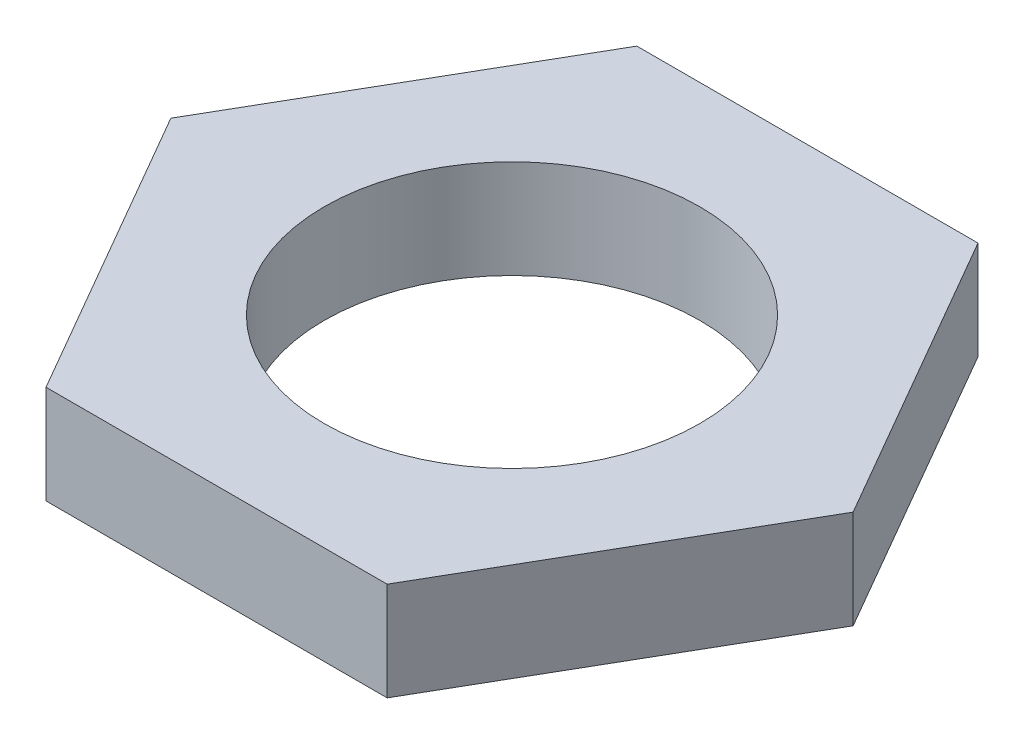
ISO-10303-21;
HEADER;
FILE_DESCRIPTION(('STEP AP214'),'2;1');
FILE_NAME('part.step','',(''),(''),'','','');
FILE_SCHEMA(('AUTOMOTIVE_DESIGN { 1 0 10303 214 1 1 1 1 }'));
ENDSEC;
DATA;
#1=APPLICATION_CONTEXT('core data for automotive mechanical design processes');
#2=APPLICATION_PROTOCOL_DEFINITION('international standard','automotive_design',2000,#1);
#3=PRODUCT_CONTEXT('',#1,'mechanical');
#4=PRODUCT('Part','Part','',(#3));
#5=PRODUCT_RELATED_PRODUCT_CATEGORY('part','',(#4));
#6=PRODUCT_DEFINITION_FORMATION('','',#4);
#7=PRODUCT_DEFINITION_CONTEXT('part definition',#1,'design');
#8=PRODUCT_DEFINITION('design','',#6,#7);
#9=PRODUCT_DEFINITION_SHAPE('','',#8);
#10=(LENGTH_UNIT() NAMED_UNIT(*) SI_UNIT(.MILLI.,.METRE.));
#11=(NAMED_UNIT(*) PLANE_ANGLE_UNIT() SI_UNIT($,.RADIAN.));
#12=(NAMED_UNIT(*) SI_UNIT($,.STERADIAN.) SOLID_ANGLE_UNIT());
#13=UNCERTAINTY_MEASURE_WITH_UNIT(LENGTH_MEASURE(1.E-05),#10,'distance_accuracy_value','');
#14=(GEOMETRIC_REPRESENTATION_CONTEXT(3) GLOBAL_UNCERTAINTY_ASSIGNED_CONTEXT((#13)) GLOBAL_UNIT_ASSIGNED_CONTEXT((#10,
#11,#12)) REPRESENTATION_CONTEXT('',''));
#15=CARTESIAN_POINT('',(0.,0.,0.));
#16=DIRECTION('',(0.,0.,1.));
#17=DIRECTION('',(1.,0.,0.));
#18=AXIS2_PLACEMENT_3D('',#15,#16,#17);
#19=CARTESIAN_POINT('',(0.,1.3,0.));
#20=DIRECTION('',(0.,1.,0.));
#21=DIRECTION('',(0.,0.,1.));
#22=AXIS2_PLACEMENT_3D('',#19,#20,#21);
#23=PLANE('',#22);
#24=DIRECTION('',(0.499999999999995,0.,-0.866025403784441));
#25=VECTOR('',#24,1.);
#26=CARTESIAN_POINT('',(2.25166604983959,1.3,3.89999999999998));
#27=LINE('',#26,#25);
#28=CARTESIAN_POINT('',(2.25166604983959,1.3,3.89999999999998));
#29=VERTEX_POINT('',#28);
#30=CARTESIAN_POINT('',(4.50333209967908,1.3,0.));
#31=VERTEX_POINT('',#30);
#32=EDGE_CURVE('E150',#29,#31,#27,.T.);
#33=ORIENTED_EDGE('',*,*,#32,.T.);
#34=DIRECTION('',(-0.500000000000001,0.,-0.866025403784438));
#35=VECTOR('',#34,1.);
#36=CARTESIAN_POINT('',(4.50333209967908,1.3,0.));
#37=LINE('',#36,#35);
#38=CARTESIAN_POINT('',(2.25166604983953,1.3,-3.90000000000001));
#39=VERTEX_POINT('',#38);
#40=EDGE_CURVE('E98',#31,#39,#37,.T.);
#41=ORIENTED_EDGE('',*,*,#40,.T.);
#42=DIRECTION('',(-1.,0.,0.));
#43=VECTOR('',#42,1.);
#44=CARTESIAN_POINT('',(2.25166604983953,1.3,-3.90000000000001));
#45=LINE('',#44,#43);
#46=CARTESIAN_POINT('',(-2.25166604983956,1.3,-3.89999999999999));
#47=VERTEX_POINT('',#46);
#48=EDGE_CURVE('E111',#39,#47,#45,.T.);
#49=ORIENTED_EDGE('',*,*,#48,.T.);
#50=DIRECTION('',(-0.499999999999995,0.,0.866025403784441));
#51=VECTOR('',#50,1.);
#52=CARTESIAN_POINT('',(-2.25166604983956,1.3,-3.89999999999999));
#53=LINE('',#52,#51);
#54=CARTESIAN_POINT('',(-4.50333209967908,1.3,0.));
#55=VERTEX_POINT('',#54);
#56=EDGE_CURVE('E105',#47,#55,#53,.T.);
#57=ORIENTED_EDGE('',*,*,#56,.T.);
#58=DIRECTION('',(0.500000000000007,0.,0.866025403784435));
#59=VECTOR('',#58,1.);
#60=CARTESIAN_POINT('',(-4.50333209967908,1.3,0.));
#61=LINE('',#60,#59);
#62=CARTESIAN_POINT('',(-2.25166604983951,1.3,3.90000000000002));
#63=VERTEX_POINT('',#62);
#64=EDGE_CURVE('E109',#55,#63,#61,.T.);
#65=ORIENTED_EDGE('',*,*,#64,.T.);
#66=DIRECTION('',(1.,0.,0.));
#67=VECTOR('',#66,1.);
#68=CARTESIAN_POINT('',(-2.25166604983951,1.3,3.90000000000002));
#69=LINE('',#68,#67);
#70=EDGE_CURVE('E61',#63,#29,#69,.T.);
#71=ORIENTED_EDGE('',*,*,#70,.T.);
#72=EDGE_LOOP('',(#33,#41,#49,#57,#65,#71));
#73=FACE_BOUND('',#72,.T.);
#74=CARTESIAN_POINT('',(0.,1.3,0.));
#75=DIRECTION('',(0.,1.,0.));
#76=DIRECTION('',(0.,0.,1.));
#77=AXIS2_PLACEMENT_3D('',#74,#75,#76);
#78=CIRCLE('',#77,2.4795);
#79=CARTESIAN_POINT('',(0.,1.3,2.4795));
#80=VERTEX_POINT('',#79);
#81=EDGE_CURVE('E138',#80,#80,#78,.T.);
#82=ORIENTED_EDGE('',*,*,#81,.F.);
#83=EDGE_LOOP('',(#82));
#84=FACE_BOUND('',#83,.T.);
#85=ADVANCED_FACE('F43',(#73,#84),#23,.T.);
#86=CARTESIAN_POINT('',(0.,0.,0.));
#87=DIRECTION('',(0.,1.,0.));
#88=DIRECTION('',(0.,0.,1.));
#89=AXIS2_PLACEMENT_3D('',#86,#87,#88);
#90=PLANE('',#89);
#91=DIRECTION('',(0.499999999999995,0.,-0.866025403784441));
#92=VECTOR('',#91,1.);
#93=CARTESIAN_POINT('',(2.25166604983959,0.,3.89999999999998));
#94=LINE('',#93,#92);
#95=CARTESIAN_POINT('',(2.25166604983959,0.,3.89999999999998));
#96=VERTEX_POINT('',#95);
#97=CARTESIAN_POINT('',(4.50333209967908,0.,0.));
#98=VERTEX_POINT('',#97);
#99=EDGE_CURVE('E133',#96,#98,#94,.T.);
#100=ORIENTED_EDGE('',*,*,#99,.F.);
#101=DIRECTION('',(1.,0.,0.));
#102=VECTOR('',#101,1.);
#103=CARTESIAN_POINT('',(-2.25166604983951,0.,3.90000000000002));
#104=LINE('',#103,#102);
#105=CARTESIAN_POINT('',(-2.25166604983951,0.,3.90000000000002));
#106=VERTEX_POINT('',#105);
#107=EDGE_CURVE('E90',#106,#96,#104,.T.);
#108=ORIENTED_EDGE('',*,*,#107,.F.);
#109=DIRECTION('',(0.500000000000007,0.,0.866025403784435));
#110=VECTOR('',#109,1.);
#111=CARTESIAN_POINT('',(-4.50333209967908,0.,0.));
#112=LINE('',#111,#110);
#113=CARTESIAN_POINT('',(-4.50333209967908,0.,0.));
#114=VERTEX_POINT('',#113);
#115=EDGE_CURVE('E84',#114,#106,#112,.T.);
#116=ORIENTED_EDGE('',*,*,#115,.F.);
#117=DIRECTION('',(-0.499999999999995,0.,0.866025403784441));
#118=VECTOR('',#117,1.);
#119=CARTESIAN_POINT('',(-2.25166604983956,0.,-3.89999999999999));
#120=LINE('',#119,#118);
#121=CARTESIAN_POINT('',(-2.25166604983956,0.,-3.89999999999999));
#122=VERTEX_POINT('',#121);
#123=EDGE_CURVE('E120',#122,#114,#120,.T.);
#124=ORIENTED_EDGE('',*,*,#123,.F.);
#125=DIRECTION('',(-1.,0.,0.));
#126=VECTOR('',#125,1.);
#127=CARTESIAN_POINT('',(2.25166604983953,0.,-3.90000000000001));
#128=LINE('',#127,#126);
#129=CARTESIAN_POINT('',(2.25166604983953,0.,-3.90000000000001));
#130=VERTEX_POINT('',#129);
#131=EDGE_CURVE('E141',#130,#122,#128,.T.);
#132=ORIENTED_EDGE('',*,*,#131,.F.);
#133=DIRECTION('',(-0.500000000000001,0.,-0.866025403784438));
#134=VECTOR('',#133,1.);
#135=CARTESIAN_POINT('',(4.50333209967908,0.,0.));
#136=LINE('',#135,#134);
#137=EDGE_CURVE('E137',#98,#130,#136,.T.);
#138=ORIENTED_EDGE('',*,*,#137,.F.);
#139=EDGE_LOOP('',(#100,#108,#116,#124,#132,#138));
#140=FACE_BOUND('',#139,.T.);
#141=CARTESIAN_POINT('',(0.,0.,0.));
#142=DIRECTION('',(0.,1.,0.));
#143=DIRECTION('',(0.,0.,1.));
#144=AXIS2_PLACEMENT_3D('',#141,#142,#143);
#145=CIRCLE('',#144,2.4795);
#146=CARTESIAN_POINT('',(0.,0.,2.4795));
#147=VERTEX_POINT('',#146);
#148=EDGE_CURVE('E247',#147,#147,#145,.T.);
#149=ORIENTED_EDGE('',*,*,#148,.T.);
#150=EDGE_LOOP('',(#149));
#151=FACE_BOUND('',#150,.T.);
#152=ADVANCED_FACE('F163',(#140,#151),#90,.F.);
#153=CARTESIAN_POINT('',(2.25166604983959,1.3,3.89999999999998));
#154=DIRECTION('',(-0.866025403784442,0.,-0.499999999999995));
#155=DIRECTION('',(-0.499999999999995,0.,0.866025403784442));
#156=AXIS2_PLACEMENT_3D('',#153,#154,#155);
#157=PLANE('',#156);
#158=ORIENTED_EDGE('',*,*,#99,.T.);
#159=DIRECTION('',(0.,-1.,0.));
#160=VECTOR('',#159,1.);
#161=CARTESIAN_POINT('',(4.50333209967908,1.3,0.));
#162=LINE('',#161,#160);
#163=EDGE_CURVE('E11',#31,#98,#162,.T.);
#164=ORIENTED_EDGE('',*,*,#163,.F.);
#165=ORIENTED_EDGE('',*,*,#32,.F.);
#166=DIRECTION('',(0.,-1.,0.));
#167=VECTOR('',#166,1.);
#168=CARTESIAN_POINT('',(2.25166604983959,1.3,3.89999999999998));
#169=LINE('',#168,#167);
#170=EDGE_CURVE('E129',#29,#96,#169,.T.);
#171=ORIENTED_EDGE('',*,*,#170,.T.);
#172=EDGE_LOOP('',(#158,#164,#165,#171));
#173=FACE_BOUND('',#172,.T.);
#174=ADVANCED_FACE('F45',(#173),#157,.F.);
#175=CARTESIAN_POINT('',(4.50333209967908,1.3,0.));
#176=DIRECTION('',(-0.866025403784438,0.,0.500000000000001));
#177=DIRECTION('',(0.500000000000001,0.,0.866025403784438));
#178=AXIS2_PLACEMENT_3D('',#175,#176,#177);
#179=PLANE('',#178);
#180=ORIENTED_EDGE('',*,*,#137,.T.);
#181=DIRECTION('',(0.,-1.,0.));
#182=VECTOR('',#181,1.);
#183=CARTESIAN_POINT('',(2.25166604983953,1.3,-3.90000000000001));
#184=LINE('',#183,#182);
#185=EDGE_CURVE('E53',#39,#130,#184,.T.);
#186=ORIENTED_EDGE('',*,*,#185,.F.);
#187=ORIENTED_EDGE('',*,*,#40,.F.);
#188=ORIENTED_EDGE('',*,*,#163,.T.);
#189=EDGE_LOOP('',(#180,#186,#187,#188));
#190=FACE_BOUND('',#189,.T.);
#191=ADVANCED_FACE('F188',(#190),#179,.F.);
#192=CARTESIAN_POINT('',(2.25166604983953,1.3,-3.90000000000001));
#193=DIRECTION('',(0.,0.,1.));
#194=DIRECTION('',(1.,0.,0.));
#195=AXIS2_PLACEMENT_3D('',#192,#193,#194);
#196=PLANE('',#195);
#197=ORIENTED_EDGE('',*,*,#131,.T.);
#198=DIRECTION('',(0.,-1.,0.));
#199=VECTOR('',#198,1.);
#200=CARTESIAN_POINT('',(-2.25166604983956,1.3,-3.89999999999999));
#201=LINE('',#200,#199);
#202=EDGE_CURVE('E122',#47,#122,#201,.T.);
#203=ORIENTED_EDGE('',*,*,#202,.F.);
#204=ORIENTED_EDGE('',*,*,#48,.F.);
#205=ORIENTED_EDGE('',*,*,#185,.T.);
#206=EDGE_LOOP('',(#197,#203,#204,#205));
#207=FACE_BOUND('',#206,.T.);
#208=ADVANCED_FACE('F160',(#207),#196,.F.);
#209=CARTESIAN_POINT('',(-2.25166604983956,1.3,-3.89999999999999));
#210=DIRECTION('',(0.866025403784441,0.,0.499999999999995));
#211=DIRECTION('',(0.499999999999995,0.,-0.866025403784442));
#212=AXIS2_PLACEMENT_3D('',#209,#210,#211);
#213=PLANE('',#212);
#214=ORIENTED_EDGE('',*,*,#123,.T.);
#215=DIRECTION('',(0.,-1.,0.));
#216=VECTOR('',#215,1.);
#217=CARTESIAN_POINT('',(-4.50333209967908,1.3,0.));
#218=LINE('',#217,#216);
#219=EDGE_CURVE('E117',#55,#114,#218,.T.);
#220=ORIENTED_EDGE('',*,*,#219,.F.);
#221=ORIENTED_EDGE('',*,*,#56,.F.);
#222=ORIENTED_EDGE('',*,*,#202,.T.);
#223=EDGE_LOOP('',(#214,#220,#221,#222));
#224=FACE_BOUND('',#223,.T.);
#225=ADVANCED_FACE('F118',(#224),#213,.F.);
#226=CARTESIAN_POINT('',(-4.50333209967908,1.3,0.));
#227=DIRECTION('',(0.866025403784435,0.,-0.500000000000007));
#228=DIRECTION('',(-0.500000000000007,0.,-0.866025403784435));
#229=AXIS2_PLACEMENT_3D('',#226,#227,#228);
#230=PLANE('',#229);
#231=ORIENTED_EDGE('',*,*,#115,.T.);
#232=DIRECTION('',(0.,-1.,0.));
#233=VECTOR('',#232,1.);
#234=CARTESIAN_POINT('',(-2.25166604983951,1.3,3.90000000000002));
#235=LINE('',#234,#233);
#236=EDGE_CURVE('E123',#63,#106,#235,.T.);
#237=ORIENTED_EDGE('',*,*,#236,.F.);
#238=ORIENTED_EDGE('',*,*,#64,.F.);
#239=ORIENTED_EDGE('',*,*,#219,.T.);
#240=EDGE_LOOP('',(#231,#237,#238,#239));
#241=FACE_BOUND('',#240,.T.);
#242=ADVANCED_FACE('F125',(#241),#230,.F.);
#243=CARTESIAN_POINT('',(-2.25166604983951,1.3,3.90000000000002));
#244=DIRECTION('',(0.,0.,-1.));
#245=DIRECTION('',(-1.,0.,0.));
#246=AXIS2_PLACEMENT_3D('',#243,#244,#245);
#247=PLANE('',#246);
#248=ORIENTED_EDGE('',*,*,#107,.T.);
#249=ORIENTED_EDGE('',*,*,#170,.F.);
#250=ORIENTED_EDGE('',*,*,#70,.F.);
#251=ORIENTED_EDGE('',*,*,#236,.T.);
#252=EDGE_LOOP('',(#248,#249,#250,#251));
#253=FACE_BOUND('',#252,.T.);
#254=ADVANCED_FACE('F168',(#253),#247,.F.);
#255=CARTESIAN_POINT('',(0.,1.3,0.));
#256=DIRECTION('',(0.,-1.,0.));
#257=DIRECTION('',(0.,0.,-1.));
#258=AXIS2_PLACEMENT_3D('',#255,#256,#257);
#259=CYLINDRICAL_SURFACE('',#258,2.4795);
#260=ORIENTED_EDGE('',*,*,#81,.T.);
#261=EDGE_LOOP('',(#260));
#262=FACE_BOUND('',#261,.T.);
#263=ORIENTED_EDGE('',*,*,#148,.F.);
#264=EDGE_LOOP('',(#263));
#265=FACE_BOUND('',#264,.T.);
#266=ADVANCED_FACE('F170',(#262,#265),#259,.F.);
#267=CLOSED_SHELL('',(#85,#152,#174,#191,#208,#225,#242,#254,#266));
#268=MANIFOLD_SOLID_BREP('B2',#267);
#269=ADVANCED_BREP_SHAPE_REPRESENTATION('',(#18,#268),#14);
#270=SHAPE_DEFINITION_REPRESENTATION(#9,#269);
ENDSEC;
END-ISO-10303-21;
